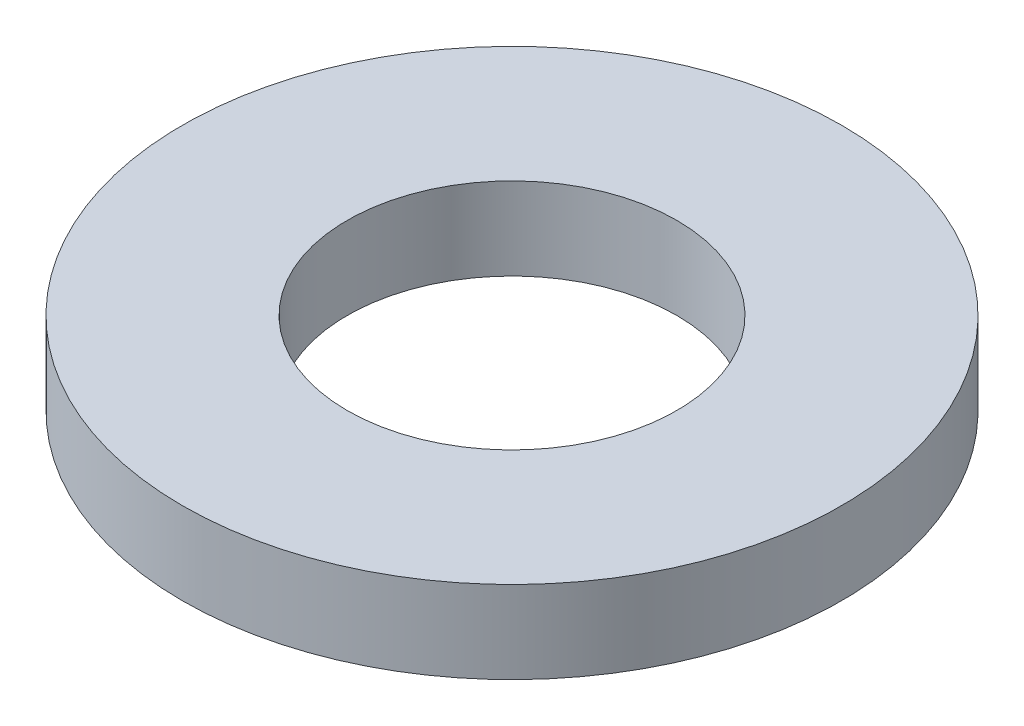
ISO-10303-21;
HEADER;
FILE_DESCRIPTION(('STEP AP214'),'2;1');
FILE_NAME('part.step','',(''),(''),'','','');
FILE_SCHEMA(('AUTOMOTIVE_DESIGN { 1 0 10303 214 1 1 1 1 }'));
ENDSEC;
DATA;
#1=APPLICATION_CONTEXT('core data for automotive mechanical design processes');
#2=APPLICATION_PROTOCOL_DEFINITION('international standard','automotive_design',2000,#1);
#3=PRODUCT_CONTEXT('',#1,'mechanical');
#4=PRODUCT('Part','Part','',(#3));
#5=PRODUCT_RELATED_PRODUCT_CATEGORY('part','',(#4));
#6=PRODUCT_DEFINITION_FORMATION('','',#4);
#7=PRODUCT_DEFINITION_CONTEXT('part definition',#1,'design');
#8=PRODUCT_DEFINITION('design','',#6,#7);
#9=PRODUCT_DEFINITION_SHAPE('','',#8);
#10=(LENGTH_UNIT() NAMED_UNIT(*) SI_UNIT(.MILLI.,.METRE.));
#11=(NAMED_UNIT(*) PLANE_ANGLE_UNIT() SI_UNIT($,.RADIAN.));
#12=(NAMED_UNIT(*) SI_UNIT($,.STERADIAN.) SOLID_ANGLE_UNIT());
#13=UNCERTAINTY_MEASURE_WITH_UNIT(LENGTH_MEASURE(1.E-05),#10,'distance_accuracy_value','');
#14=(GEOMETRIC_REPRESENTATION_CONTEXT(3) GLOBAL_UNCERTAINTY_ASSIGNED_CONTEXT((#13)) GLOBAL_UNIT_ASSIGNED_CONTEXT((#10,
#11,#12)) REPRESENTATION_CONTEXT('',''));
#15=CARTESIAN_POINT('',(0.,0.,0.));
#16=DIRECTION('',(0.,0.,1.));
#17=DIRECTION('',(1.,0.,0.));
#18=AXIS2_PLACEMENT_3D('',#15,#16,#17);
#19=CARTESIAN_POINT('',(0.,10.,0.));
#20=DIRECTION('',(0.,-1.,0.));
#21=DIRECTION('',(0.,0.,-1.));
#22=AXIS2_PLACEMENT_3D('',#19,#20,#21);
#23=CYLINDRICAL_SURFACE('',#22,40.);
#24=CARTESIAN_POINT('',(0.,10.,0.));
#25=DIRECTION('',(0.,1.,0.));
#26=DIRECTION('',(0.,0.,1.));
#27=AXIS2_PLACEMENT_3D('',#24,#25,#26);
#28=CIRCLE('',#27,40.);
#29=CARTESIAN_POINT('',(0.,10.,40.));
#30=VERTEX_POINT('',#29);
#31=EDGE_CURVE('E10',#30,#30,#28,.T.);
#32=ORIENTED_EDGE('',*,*,#31,.F.);
#33=EDGE_LOOP('',(#32));
#34=FACE_BOUND('',#33,.T.);
#35=CARTESIAN_POINT('',(0.,0.,0.));
#36=DIRECTION('',(0.,1.,0.));
#37=DIRECTION('',(0.,0.,1.));
#38=AXIS2_PLACEMENT_3D('',#35,#36,#37);
#39=CIRCLE('',#38,40.);
#40=CARTESIAN_POINT('',(0.,0.,40.));
#41=VERTEX_POINT('',#40);
#42=EDGE_CURVE('E37',#41,#41,#39,.T.);
#43=ORIENTED_EDGE('',*,*,#42,.T.);
#44=EDGE_LOOP('',(#43));
#45=FACE_BOUND('',#44,.T.);
#46=ADVANCED_FACE('F40',(#34,#45),#23,.T.);
#47=CARTESIAN_POINT('',(0.,10.,0.));
#48=DIRECTION('',(0.,1.,0.));
#49=DIRECTION('',(0.,0.,1.));
#50=AXIS2_PLACEMENT_3D('',#47,#48,#49);
#51=PLANE('',#50);
#52=CARTESIAN_POINT('',(0.,10.,0.));
#53=DIRECTION('',(0.,1.,0.));
#54=DIRECTION('',(0.,0.,1.));
#55=AXIS2_PLACEMENT_3D('',#52,#53,#54);
#56=CIRCLE('',#55,20.);
#57=CARTESIAN_POINT('',(0.,10.,20.));
#58=VERTEX_POINT('',#57);
#59=EDGE_CURVE('E50',#58,#58,#56,.T.);
#60=ORIENTED_EDGE('',*,*,#59,.F.);
#61=EDGE_LOOP('',(#60));
#62=FACE_BOUND('',#61,.T.);
#63=ORIENTED_EDGE('',*,*,#31,.T.);
#64=EDGE_LOOP('',(#63));
#65=FACE_BOUND('',#64,.T.);
#66=ADVANCED_FACE('F59',(#62,#65),#51,.T.);
#67=CARTESIAN_POINT('',(0.,0.,0.));
#68=DIRECTION('',(0.,1.,0.));
#69=DIRECTION('',(0.,0.,1.));
#70=AXIS2_PLACEMENT_3D('',#67,#68,#69);
#71=PLANE('',#70);
#72=CARTESIAN_POINT('',(0.,0.,0.));
#73=DIRECTION('',(0.,1.,0.));
#74=DIRECTION('',(0.,0.,1.));
#75=AXIS2_PLACEMENT_3D('',#72,#73,#74);
#76=CIRCLE('',#75,20.);
#77=CARTESIAN_POINT('',(0.,0.,20.));
#78=VERTEX_POINT('',#77);
#79=EDGE_CURVE('E47',#78,#78,#76,.T.);
#80=ORIENTED_EDGE('',*,*,#79,.T.);
#81=EDGE_LOOP('',(#80));
#82=FACE_BOUND('',#81,.T.);
#83=ORIENTED_EDGE('',*,*,#42,.F.);
#84=EDGE_LOOP('',(#83));
#85=FACE_BOUND('',#84,.T.);
#86=ADVANCED_FACE('F58',(#82,#85),#71,.F.);
#87=CARTESIAN_POINT('',(0.,10.,0.));
#88=DIRECTION('',(0.,-1.,0.));
#89=DIRECTION('',(0.,0.,-1.));
#90=AXIS2_PLACEMENT_3D('',#87,#88,#89);
#91=CYLINDRICAL_SURFACE('',#90,20.);
#92=ORIENTED_EDGE('',*,*,#59,.T.);
#93=EDGE_LOOP('',(#92));
#94=FACE_BOUND('',#93,.T.);
#95=ORIENTED_EDGE('',*,*,#79,.F.);
#96=EDGE_LOOP('',(#95));
#97=FACE_BOUND('',#96,.T.);
#98=ADVANCED_FACE('F54',(#94,#97),#91,.F.);
#99=CLOSED_SHELL('',(#46,#66,#86,#98));
#100=MANIFOLD_SOLID_BREP('B2',#99);
#101=ADVANCED_BREP_SHAPE_REPRESENTATION('',(#18,#100),#14);
#102=SHAPE_DEFINITION_REPRESENTATION(#9,#101);
ENDSEC;
END-ISO-10303-21;
